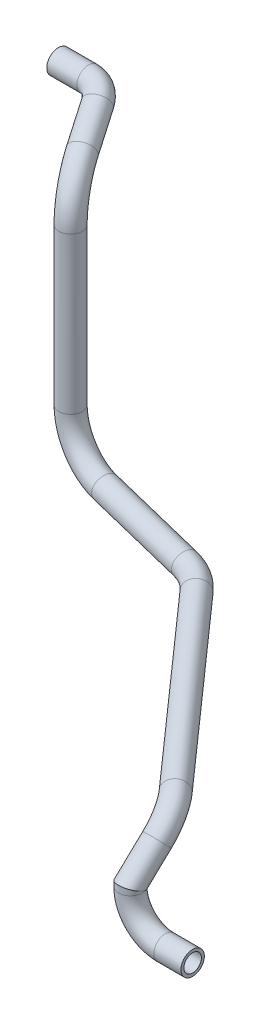
ISO-10303-21;
HEADER;
FILE_DESCRIPTION(('STEP AP214'),'2;1');
FILE_NAME('part.step','',(''),(''),'','','');
FILE_SCHEMA(('AUTOMOTIVE_DESIGN { 1 0 10303 214 1 1 1 1 }'));
ENDSEC;
DATA;
#1=APPLICATION_CONTEXT('core data for automotive mechanical design processes');
#2=APPLICATION_PROTOCOL_DEFINITION('international standard','automotive_design',2000,#1);
#3=PRODUCT_CONTEXT('',#1,'mechanical');
#4=PRODUCT('Part','Part','',(#3));
#5=PRODUCT_RELATED_PRODUCT_CATEGORY('part','',(#4));
#6=PRODUCT_DEFINITION_FORMATION('','',#4);
#7=PRODUCT_DEFINITION_CONTEXT('part definition',#1,'design');
#8=PRODUCT_DEFINITION('design','',#6,#7);
#9=PRODUCT_DEFINITION_SHAPE('','',#8);
#10=(LENGTH_UNIT() NAMED_UNIT(*) SI_UNIT(.MILLI.,.METRE.));
#11=(NAMED_UNIT(*) PLANE_ANGLE_UNIT() SI_UNIT($,.RADIAN.));
#12=(NAMED_UNIT(*) SI_UNIT($,.STERADIAN.) SOLID_ANGLE_UNIT());
#13=UNCERTAINTY_MEASURE_WITH_UNIT(LENGTH_MEASURE(1.E-05),#10,'distance_accuracy_value','');
#14=(GEOMETRIC_REPRESENTATION_CONTEXT(3) GLOBAL_UNCERTAINTY_ASSIGNED_CONTEXT((#13)) GLOBAL_UNIT_ASSIGNED_CONTEXT((#10,
#11,#12)) REPRESENTATION_CONTEXT('',''));
#15=CARTESIAN_POINT('',(0.,0.,0.));
#16=DIRECTION('',(0.,0.,1.));
#17=DIRECTION('',(1.,0.,0.));
#18=AXIS2_PLACEMENT_3D('',#15,#16,#17);
#19=CARTESIAN_POINT('',(1326.71933266064,229.978267256309,637.655463589521));
#20=DIRECTION('',(1.,1.91278449576007E-13,0.));
#21=DIRECTION('',(-1.82115262685281E-13,0.959887574891388,0.280385170023543));
#22=AXIS2_PLACEMENT_3D('',#19,#20,#21);
#23=PLANE('',#22);
#24=CARTESIAN_POINT('',(1326.71933266064,229.978267256309,637.655463589521));
#25=DIRECTION('',(1.,1.91278449576007E-13,0.));
#26=DIRECTION('',(-1.82115262685281E-13,0.959887574891388,0.280385170023543));
#27=AXIS2_PLACEMENT_3D('',#24,#25,#26);
#28=CIRCLE('',#27,7.50000000000001);
#29=CARTESIAN_POINT('',(1326.71933266064,237.478267256309,637.655463589521));
#30=VERTEX_POINT('',#29);
#31=EDGE_CURVE('E108',#30,#30,#28,.T.);
#32=ORIENTED_EDGE('',*,*,#31,.F.);
#33=EDGE_LOOP('',(#32));
#34=FACE_BOUND('',#33,.T.);
#35=CARTESIAN_POINT('',(1326.71933266064,229.978267256309,637.655463589521));
#36=DIRECTION('',(1.,1.91278449576007E-13,0.));
#37=DIRECTION('',(-1.91278449576007E-13,1.,0.));
#38=AXIS2_PLACEMENT_3D('',#35,#36,#37);
#39=CIRCLE('',#38,10.);
#40=CARTESIAN_POINT('',(1326.71933266064,239.978267256309,637.655463589521));
#41=VERTEX_POINT('',#40);
#42=EDGE_CURVE('E216',#41,#41,#39,.T.);
#43=ORIENTED_EDGE('',*,*,#42,.T.);
#44=EDGE_LOOP('',(#43));
#45=FACE_BOUND('',#44,.T.);
#46=ADVANCED_FACE('F45',(#34,#45),#23,.T.);
#47=CARTESIAN_POINT('',(924.394560432527,551.886928198318,349.944058457307));
#48=DIRECTION('',(1.,0.,0.));
#49=DIRECTION('',(0.,0.,-1.));
#50=AXIS2_PLACEMENT_3D('',#47,#48,#49);
#51=PLANE('',#50);
#52=CARTESIAN_POINT('',(924.394560432527,551.886928198318,349.944058457307));
#53=DIRECTION('',(1.,0.,0.));
#54=DIRECTION('',(0.,0.,-1.));
#55=AXIS2_PLACEMENT_3D('',#52,#53,#54);
#56=CIRCLE('',#55,7.50000000000001);
#57=CARTESIAN_POINT('',(924.394560432527,551.886928198318,342.444058457307));
#58=VERTEX_POINT('',#57);
#59=EDGE_CURVE('E110',#58,#58,#56,.T.);
#60=ORIENTED_EDGE('',*,*,#59,.T.);
#61=EDGE_LOOP('',(#60));
#62=FACE_BOUND('',#61,.T.);
#63=CARTESIAN_POINT('',(924.394560432527,551.886928198318,349.944058457307));
#64=DIRECTION('',(1.,0.,0.));
#65=DIRECTION('',(0.,0.,-1.));
#66=AXIS2_PLACEMENT_3D('',#63,#64,#65);
#67=CIRCLE('',#66,10.);
#68=CARTESIAN_POINT('',(924.394560432527,551.886928198318,339.944058457307));
#69=VERTEX_POINT('',#68);
#70=EDGE_CURVE('E49',#69,#69,#67,.T.);
#71=ORIENTED_EDGE('',*,*,#70,.F.);
#72=EDGE_LOOP('',(#71));
#73=FACE_BOUND('',#72,.T.);
#74=ADVANCED_FACE('F129',(#62,#73),#51,.F.);
#75=CARTESIAN_POINT('',(1303.5027571416,259.978267256305,637.655463589521));
#76=DIRECTION('',(0.,0.,1.));
#77=DIRECTION('',(1.,0.,0.));
#78=AXIS2_PLACEMENT_3D('',#75,#76,#77);
#79=TOROIDAL_SURFACE('',#78,29.9999999999998,10.);
#80=CARTESIAN_POINT('',(1263.98182357155,259.978267256305,634.597388385274));
#81=CARTESIAN_POINT('',(1264.02530421719,259.919516422859,634.46202464073));
#82=CARTESIAN_POINT('',(1264.0717736119,259.860712029914,634.327664404741));
#83=CARTESIAN_POINT('',(1264.1706544685,259.743312860982,634.061052613183));
#84=CARTESIAN_POINT('',(1264.22306602734,259.684718088432,633.928801092067));
#85=CARTESIAN_POINT('',(1264.38915745745,259.509727333325,633.535371212634));
#86=CARTESIAN_POINT('',(1264.51169492261,259.39412376748,633.277514922438));
#87=CARTESIAN_POINT('',(1264.78008096923,259.166687538459,632.771699525254));
#88=CARTESIAN_POINT('',(1264.92597937691,259.054863568399,632.523763021426));
#89=CARTESIAN_POINT('',(1265.2401968972,258.836665582143,632.039997792839));
#90=CARTESIAN_POINT('',(1265.40851433395,258.730291159405,631.804168164889));
#91=CARTESIAN_POINT('',(1265.76703549509,258.524026695621,631.345917713136));
#92=CARTESIAN_POINT('',(1265.95727981063,258.424149234084,631.123522958191));
#93=CARTESIAN_POINT('',(1266.35832160313,258.232213834752,630.694437885318));
#94=CARTESIAN_POINT('',(1266.56911844966,258.140155657262,630.487747086019));
#95=CARTESIAN_POINT('',(1267.00976423354,257.964965144727,630.092096021607));
#96=CARTESIAN_POINT('',(1267.23959381107,257.881823932389,629.903118146464));
#97=CARTESIAN_POINT('',(1267.71697302702,257.725296066663,629.544488825477));
#98=CARTESIAN_POINT('',(1267.9645215693,257.65190881067,629.374836185805));
#99=CARTESIAN_POINT('',(1268.46307680964,257.519056797342,629.064423115292));
#100=CARTESIAN_POINT('',(1268.71332167527,257.45908652215,628.922655180412));
#101=CARTESIAN_POINT('',(1269.22651868171,257.349356993228,628.659683292147));
#102=CARTESIAN_POINT('',(1269.4894695194,257.299596695095,628.538477235653));
#103=CARTESIAN_POINT('',(1270.02615945138,257.210810076757,628.317987280597));
#104=CARTESIAN_POINT('',(1270.29989837077,257.171783582615,628.218703026807));
#105=CARTESIAN_POINT('',(1270.85602171002,257.104873809584,628.043288626941));
#106=CARTESIAN_POINT('',(1271.13840558985,257.076989836185,627.967157037838));
#107=CARTESIAN_POINT('',(1271.6898386445,257.034158994872,627.843492789611));
#108=CARTESIAN_POINT('',(1271.95846976504,257.018454456958,627.794353716406));
#109=CARTESIAN_POINT('',(1272.49919455948,256.997039695264,627.717718036293));
#110=CARTESIAN_POINT('',(1272.77128806392,256.991328984227,627.690220374272));
#111=CARTESIAN_POINT('',(1273.31672997233,256.989878885704,627.65733383759));
#112=CARTESIAN_POINT('',(1273.59007784525,256.994135608514,627.651936340788));
#113=CARTESIAN_POINT('',(1274.13597270369,257.012462683753,627.663457884769));
#114=CARTESIAN_POINT('',(1274.40851971038,257.026532774348,627.680376330142));
#115=CARTESIAN_POINT('',(1274.93776641562,257.063314589054,627.735174695803));
#116=CARTESIAN_POINT('',(1275.19460444181,257.085584601899,627.772021931788));
#117=CARTESIAN_POINT('',(1275.70372989309,257.138437251726,627.865707147832));
#118=CARTESIAN_POINT('',(1275.95601749748,257.169019560436,627.922544338467));
#119=CARTESIAN_POINT('',(1276.45425572186,257.238069469412,628.055758885636));
#120=CARTESIAN_POINT('',(1276.70020666815,257.276536662757,628.132135233847));
#121=CARTESIAN_POINT('',(1277.18411626162,257.360859753398,628.303780559127));
#122=CARTESIAN_POINT('',(1277.42207481614,257.406715736322,628.399049755143));
#123=CARTESIAN_POINT('',(1277.88816978576,257.505202688651,628.607515628218));
#124=CARTESIAN_POINT('',(1278.11631809738,257.55782512465,628.720689765461));
#125=CARTESIAN_POINT('',(1278.56173945621,257.669306989327,628.964060743184));
#126=CARTESIAN_POINT('',(1278.77901255941,257.728166385889,629.094257496011));
#127=CARTESIAN_POINT('',(1279.20150309328,257.851532568191,629.370562332977));
#128=CARTESIAN_POINT('',(1279.4067200701,257.916039566314,629.516671015544));
#129=CARTESIAN_POINT('',(1279.80409820257,258.050123909875,629.823592302212));
#130=CARTESIAN_POINT('',(1279.99625815758,258.11970172038,629.984406255339));
#131=CARTESIAN_POINT('',(1280.37682388871,258.267313450438,630.328626954554));
#132=CARTESIAN_POINT('',(1280.56444806058,258.345601779865,630.512788616528));
#133=CARTESIAN_POINT('',(1280.92347319595,258.506640236142,630.894496786389));
#134=CARTESIAN_POINT('',(1281.09487278363,258.589390740448,631.092044426962));
#135=CARTESIAN_POINT('',(1281.42089870901,258.758902891765,631.498987982933));
#136=CARTESIAN_POINT('',(1281.57552022843,258.845665680865,631.708387275725));
#137=CARTESIAN_POINT('',(1281.86751428816,259.022861981623,632.137394217022));
#138=CARTESIAN_POINT('',(1282.00488786293,259.113295272707,632.357001252223));
#139=CARTESIAN_POINT('',(1282.21840762213,259.266419758863,632.728717786881));
#140=CARTESIAN_POINT('',(1282.29950481537,259.328103954833,632.878425702239));
#141=CARTESIAN_POINT('',(1282.45399130726,259.453120381867,633.181069167841));
#142=CARTESIAN_POINT('',(1282.52738181704,259.516452352025,633.33400420639));
#143=CARTESIAN_POINT('',(1282.66622354209,259.644765114301,633.642151819448));
#144=CARTESIAN_POINT('',(1282.73169692156,259.709740657208,633.79735660488));
#145=CARTESIAN_POINT('',(1282.8549351749,259.8420772792,634.109819077006));
#146=CARTESIAN_POINT('',(1282.91269919601,259.909438621138,634.267076988689));
#147=CARTESIAN_POINT('',(1282.96659484574,259.978267256305,634.425018432948));
#148=B_SPLINE_CURVE_WITH_KNOTS('',3,(#80,#81,#82,#83,#84,#85,#86,#87,#88,#89,#90,#91,#92,#93,
#94,#95,#96,#97,#98,#99,#100,#101,#102,#103,#104,#105,#106,#107,#108,#109,#110,#111,#112,#113,
#114,#115,#116,#117,#118,#119,#120,#121,#122,#123,#124,#125,#126,#127,#128,#129,#130,#131,#132,
#133,#134,#135,#136,#137,#138,#139,#140,#141,#142,#143,#144,#145,#146,#147),.UNSPECIFIED.,.F.,
.F.,(4,2,2,2,2,2,2,2,2,2,2,2,2,2,2,2,2,2,2,2,2,2,2,2,2,2,2,2,2,2,2,2,2,4),(0.,0.461440553169758,
0.922888637512019,1.84577590288652,2.77065846451886,3.69547192797506,4.622025773743,
5.5485512065477,6.47414550241863,7.39968258806917,8.27993455517271,9.16009643406635,
10.0402440494811,10.9203367970273,11.7399193644963,12.5594619713566,13.3786848120585,
14.1978857955938,14.9782167671175,15.7585169260206,16.5387768254664,17.3190457677509,
18.0983401638465,18.8776305473288,19.6569502491247,20.4363415157453,21.2584060724022,
22.0805402770337,22.9029099585144,23.7252302938308,24.2683221463531,24.8113285234584,
25.3527777048265,25.8942867267905),.UNSPECIFIED.);
#149=CARTESIAN_POINT('',(1263.98182357155,259.978267256305,634.597388385274));
#150=VERTEX_POINT('',#149);
#151=CARTESIAN_POINT('',(1282.96659484574,259.978267256305,634.425018432948));
#152=VERTEX_POINT('',#151);
#153=EDGE_CURVE('E12',#150,#152,#148,.T.);
#154=ORIENTED_EDGE('',*,*,#153,.T.);
#155=CARTESIAN_POINT('',(1273.5027571416,259.978267256305,637.655463589521));
#156=DIRECTION('',(0.,1.,0.));
#157=DIRECTION('',(-1.,0.,0.));
#158=AXIS2_PLACEMENT_3D('',#155,#156,#157);
#159=CIRCLE('',#158,10.);
#160=EDGE_CURVE('E80',#152,#150,#159,.F.);
#161=ORIENTED_EDGE('',*,*,#160,.T.);
#162=EDGE_LOOP('',(#154,#161));
#163=FACE_BOUND('',#162,.T.);
#164=CARTESIAN_POINT('',(1303.5027571416,229.978267256305,637.655463589521));
#165=DIRECTION('',(1.,1.78130524173896E-13,0.));
#166=DIRECTION('',(-1.78130524173896E-13,1.,0.));
#167=AXIS2_PLACEMENT_3D('',#164,#165,#166);
#168=CIRCLE('',#167,10.);
#169=CARTESIAN_POINT('',(1303.5027571416,239.978267256305,637.655463589521));
#170=VERTEX_POINT('',#169);
#171=EDGE_CURVE('E218',#170,#170,#168,.T.);
#172=ORIENTED_EDGE('',*,*,#171,.F.);
#173=EDGE_LOOP('',(#172));
#174=FACE_BOUND('',#173,.T.);
#175=ADVANCED_FACE('F124',(#163,#174),#79,.T.);
#176=CARTESIAN_POINT('',(1303.5027571416,229.978267256305,637.655463589521));
#177=DIRECTION('',(1.,1.78130524173896E-13,0.));
#178=DIRECTION('',(-1.78130524173896E-13,1.,0.));
#179=AXIS2_PLACEMENT_3D('',#176,#177,#178);
#180=CYLINDRICAL_SURFACE('',#179,10.);
#181=ORIENTED_EDGE('',*,*,#42,.F.);
#182=EDGE_LOOP('',(#181));
#183=FACE_BOUND('',#182,.T.);
#184=ORIENTED_EDGE('',*,*,#171,.T.);
#185=EDGE_LOOP('',(#184));
#186=FACE_BOUND('',#185,.T.);
#187=ADVANCED_FACE('F128',(#183,#186),#180,.T.);
#188=CARTESIAN_POINT('',(1273.5027571416,269.358231494666,637.655463589521));
#189=DIRECTION('',(0.,-1.,0.));
#190=DIRECTION('',(0.,0.,-1.));
#191=AXIS2_PLACEMENT_3D('',#188,#189,#190);
#192=CYLINDRICAL_SURFACE('',#191,10.);
#193=ORIENTED_EDGE('',*,*,#160,.F.);
#194=CARTESIAN_POINT('',(1273.5027571416,261.346615098881,637.655463589521));
#195=DIRECTION('',(0.0036227570881128,-0.916939720474375,0.399009303961017));
#196=DIRECTION('',(-0.00832490102017448,-0.399025749816193,-0.916901928783351));
#197=AXIS2_PLACEMENT_3D('',#194,#195,#196);
#198=ELLIPSE('',#197,10.9058423107972,10.);
#199=EDGE_CURVE('E54',#152,#150,#198,.T.);
#200=ORIENTED_EDGE('',*,*,#199,.T.);
#201=EDGE_LOOP('',(#193,#200));
#202=FACE_BOUND('',#201,.T.);
#203=ADVANCED_FACE('F132',(#202),#192,.T.);
#204=CARTESIAN_POINT('',(924.394560432527,551.886928198318,349.944058457307));
#205=DIRECTION('',(1.,0.,0.));
#206=DIRECTION('',(0.,0.,-1.));
#207=AXIS2_PLACEMENT_3D('',#204,#205,#206);
#208=CYLINDRICAL_SURFACE('',#207,10.);
#209=ORIENTED_EDGE('',*,*,#70,.T.);
#210=EDGE_LOOP('',(#209));
#211=FACE_BOUND('',#210,.T.);
#212=CARTESIAN_POINT('',(950.051959041406,551.886928198417,349.944058457058));
#213=DIRECTION('',(-1.,4.02348238924295E-12,-8.99020734086618E-12));
#214=DIRECTION('',(-8.99020734086617E-12,0.,1.));
#215=AXIS2_PLACEMENT_3D('',#212,#213,#214);
#216=CIRCLE('',#215,10.);
#217=CARTESIAN_POINT('',(950.051959041504,555.971897918981,340.816461709717));
#218=VERTEX_POINT('',#217);
#219=EDGE_CURVE('E214',#218,#218,#216,.F.);
#220=ORIENTED_EDGE('',*,*,#219,.F.);
#221=EDGE_LOOP('',(#220));
#222=FACE_BOUND('',#221,.T.);
#223=ADVANCED_FACE('F136',(#211,#222),#208,.T.);
#224=CARTESIAN_POINT('',(950.051959041209,543.716988757178,368.199251951984));
#225=DIRECTION('',(0.,-0.912759674734094,-0.408496972056478));
#226=DIRECTION('',(0.,0.408496972056478,-0.912759674734094));
#227=AXIS2_PLACEMENT_3D('',#224,#225,#226);
#228=TOROIDAL_SURFACE('',#227,20.0000000002676,10.);
#229=CARTESIAN_POINT('',(967.94091115379,547.370363158069,360.036026621229));
#230=DIRECTION('',(0.447172763911726,-0.365379138562776,0.816415705580601));
#231=DIRECTION('',(0.877056450674605,0.,-0.48038732532204));
#232=AXIS2_PLACEMENT_3D('',#229,#230,#231);
#233=CIRCLE('',#232,10.);
#234=CARTESIAN_POINT('',(976.88538721032,549.197050358564,355.954413955742));
#235=VERTEX_POINT('',#234);
#236=EDGE_CURVE('E211',#235,#235,#233,.T.);
#237=CARTESIAN_POINT('',(950.051959041209,543.716988757178,368.199251951984));
#238=DIRECTION('',(0.,-0.912759674734094,-0.408496972056478));
#239=DIRECTION('',(0.,0.408496972056478,-0.912759674734094));
#240=AXIS2_PLACEMENT_3D('',#237,#238,#239);
#241=CIRCLE('',#240,30.0000000002676);
#242=EDGE_CURVE('',#218,#235,#241,.T.);
#243=ORIENTED_EDGE('',*,*,#219,.T.);
#244=ORIENTED_EDGE('',*,*,#236,.F.);
#245=ORIENTED_EDGE('',*,*,#242,.T.);
#246=ORIENTED_EDGE('',*,*,#242,.F.);
#247=EDGE_LOOP('',(#243,#245,#244,#246));
#248=FACE_BOUND('',#247,.T.);
#249=ADVANCED_FACE('F139',(#248),#228,.T.);
#250=CARTESIAN_POINT('',(967.94091115379,547.370363158069,360.036026621229));
#251=DIRECTION('',(0.447172763911726,-0.365379138562776,0.816415705580601));
#252=DIRECTION('',(0.877056450674605,0.,-0.48038732532204));
#253=AXIS2_PLACEMENT_3D('',#250,#251,#252);
#254=CYLINDRICAL_SURFACE('',#253,10.);
#255=CARTESIAN_POINT('',(983.689410480829,534.502466045028,388.788498210619));
#256=DIRECTION('',(-0.447172763911711,0.365379138562786,-0.816415705580605));
#257=DIRECTION('',(-0.877056450674613,0.,0.480387325322026));
#258=AXIS2_PLACEMENT_3D('',#255,#256,#257);
#259=CIRCLE('',#258,10.);
#260=CARTESIAN_POINT('',(985.444645551856,543.811053935268,391.993079514803));
#261=VERTEX_POINT('',#260);
#262=EDGE_CURVE('E208',#261,#261,#259,.F.);
#263=ORIENTED_EDGE('',*,*,#262,.F.);
#264=EDGE_LOOP('',(#263));
#265=FACE_BOUND('',#264,.T.);
#266=ORIENTED_EDGE('',*,*,#236,.T.);
#267=EDGE_LOOP('',(#266));
#268=FACE_BOUND('',#267,.T.);
#269=ADVANCED_FACE('F143',(#265,#268),#254,.T.);
#270=CARTESIAN_POINT('',(976.668470196724,497.268114484071,375.970172993882));
#271=DIRECTION('',(0.877056450674613,0.,-0.480387325322027));
#272=DIRECTION('',(-0.480387325322027,0.,-0.877056450674613));
#273=AXIS2_PLACEMENT_3D('',#270,#271,#272);
#274=TOROIDAL_SURFACE('',#273,39.9999999999999,10.);
#275=CARTESIAN_POINT('',(995.883963209605,497.268114484071,411.052431020866));
#276=DIRECTION('',(0.,-1.,0.));
#277=DIRECTION('',(0.,0.,-1.));
#278=AXIS2_PLACEMENT_3D('',#275,#276,#277);
#279=CIRCLE('',#278,10.);
#280=CARTESIAN_POINT('',(1000.68783646283,497.268114484071,419.822995527612));
#281=VERTEX_POINT('',#280);
#282=EDGE_CURVE('E205',#281,#281,#279,.T.);
#283=CARTESIAN_POINT('',(976.668470196724,497.268114484071,375.970172993882));
#284=DIRECTION('',(0.877056450674613,0.,-0.480387325322027));
#285=DIRECTION('',(-0.480387325322027,0.,-0.877056450674613));
#286=AXIS2_PLACEMENT_3D('',#283,#284,#285);
#287=CIRCLE('',#286,49.9999999999999);
#288=EDGE_CURVE('',#261,#281,#287,.T.);
#289=ORIENTED_EDGE('',*,*,#262,.T.);
#290=ORIENTED_EDGE('',*,*,#282,.F.);
#291=ORIENTED_EDGE('',*,*,#288,.T.);
#292=ORIENTED_EDGE('',*,*,#288,.F.);
#293=EDGE_LOOP('',(#289,#291,#290,#292));
#294=FACE_BOUND('',#293,.T.);
#295=ADVANCED_FACE('F147',(#294),#274,.T.);
#296=CARTESIAN_POINT('',(995.883963209605,497.268114484071,411.052431020866));
#297=DIRECTION('',(0.,-1.,0.));
#298=DIRECTION('',(0.,0.,-1.));
#299=AXIS2_PLACEMENT_3D('',#296,#297,#298);
#300=CYLINDRICAL_SURFACE('',#299,10.);
#301=CARTESIAN_POINT('',(995.883963209605,363.99398977692,411.052431020866));
#302=DIRECTION('',(0.,1.,0.));
#303=DIRECTION('',(-1.,0.,0.));
#304=AXIS2_PLACEMENT_3D('',#301,#302,#303);
#305=CIRCLE('',#304,10.);
#306=CARTESIAN_POINT('',(986.037233937508,363.99398977692,409.308320175184));
#307=VERTEX_POINT('',#306);
#308=EDGE_CURVE('E202',#307,#307,#305,.F.);
#309=ORIENTED_EDGE('',*,*,#308,.F.);
#310=EDGE_LOOP('',(#309));
#311=FACE_BOUND('',#310,.T.);
#312=ORIENTED_EDGE('',*,*,#282,.T.);
#313=EDGE_LOOP('',(#312));
#314=FACE_BOUND('',#313,.T.);
#315=ADVANCED_FACE('F151',(#311,#314),#300,.T.);
#316=CARTESIAN_POINT('',(1035.27088029799,363.99398977692,418.028874403593));
#317=DIRECTION('',(-0.174411084568181,0.,0.984672927209716));
#318=DIRECTION('',(0.984672927209716,0.,0.174411084568181));
#319=AXIS2_PLACEMENT_3D('',#316,#317,#318);
#320=TOROIDAL_SURFACE('',#319,40.0000000000003,10.);
#321=CARTESIAN_POINT('',(1031.7211454463,324.156770296676,417.400124401125));
#322=DIRECTION('',(0.980665787937679,-0.0901247194271574,0.173701316393248));
#323=DIRECTION('',(0.174411084568181,0.,-0.984672927209716));
#324=AXIS2_PLACEMENT_3D('',#321,#322,#323);
#325=CIRCLE('',#324,10.);
#326=CARTESIAN_POINT('',(1030.83371173338,314.197465426615,417.242936900508));
#327=VERTEX_POINT('',#326);
#328=EDGE_CURVE('E199',#327,#327,#325,.T.);
#329=CARTESIAN_POINT('',(1035.27088029799,363.99398977692,418.028874403593));
#330=DIRECTION('',(-0.174411084568181,0.,0.984672927209716));
#331=DIRECTION('',(0.984672927209716,0.,0.174411084568181));
#332=AXIS2_PLACEMENT_3D('',#329,#330,#331);
#333=CIRCLE('',#332,50.0000000000003);
#334=EDGE_CURVE('',#307,#327,#333,.T.);
#335=ORIENTED_EDGE('',*,*,#308,.T.);
#336=ORIENTED_EDGE('',*,*,#328,.F.);
#337=ORIENTED_EDGE('',*,*,#334,.T.);
#338=ORIENTED_EDGE('',*,*,#334,.F.);
#339=EDGE_LOOP('',(#335,#337,#336,#338));
#340=FACE_BOUND('',#339,.T.);
#341=ADVANCED_FACE('F155',(#340),#320,.T.);
#342=CARTESIAN_POINT('',(1031.7211454463,324.156770296676,417.400124401125));
#343=DIRECTION('',(0.980665787937679,-0.0901247194271574,0.173701316393248));
#344=DIRECTION('',(0.174411084568181,0.,-0.984672927209716));
#345=AXIS2_PLACEMENT_3D('',#342,#343,#344);
#346=CYLINDRICAL_SURFACE('',#345,10.);
#347=CARTESIAN_POINT('',(1114.53757456698,316.545810956332,432.069059459523));
#348=DIRECTION('',(-0.980665787937678,0.0901247194271558,-0.173701316393255));
#349=DIRECTION('',(-0.174411084568188,0.,0.984672927209715));
#350=AXIS2_PLACEMENT_3D('',#347,#348,#349);
#351=CIRCLE('',#350,10.);
#352=CARTESIAN_POINT('',(1116.30494994655,316.813997202408,422.230133684566));
#353=VERTEX_POINT('',#352);
#354=EDGE_CURVE('E196',#353,#353,#351,.F.);
#355=ORIENTED_EDGE('',*,*,#354,.F.);
#356=EDGE_LOOP('',(#355));
#357=FACE_BOUND('',#356,.T.);
#358=ORIENTED_EDGE('',*,*,#328,.T.);
#359=EDGE_LOOP('',(#358));
#360=FACE_BOUND('',#359,.T.);
#361=ADVANCED_FACE('F159',(#357,#360),#346,.T.);
#362=CARTESIAN_POINT('',(1107.4680730487,315.473065972029,471.42476255935));
#363=DIRECTION('',(-0.0840146120950681,-0.99556933275505,-0.0422285286527977));
#364=DIRECTION('',(0.996458195554835,-0.0840896219018919,0.));
#365=AXIS2_PLACEMENT_3D('',#362,#363,#364);
#366=TOROIDAL_SURFACE('',#365,40.,10.);
#367=CARTESIAN_POINT('',(1137.49967544678,314.057847324898,445.041055208322));
#368=DIRECTION('',(0.655176183046922,-0.0871201830270747,0.750436035167152));
#369=DIRECTION('',(0.753300226868124,0.,-0.657676796154793));
#370=AXIS2_PLACEMENT_3D('',#367,#368,#369);
#371=CIRCLE('',#370,10.);
#372=CARTESIAN_POINT('',(1145.0075760463,313.704042663115,438.445128370565));
#373=VERTEX_POINT('',#372);
#374=EDGE_CURVE('E191',#373,#373,#371,.T.);
#375=CARTESIAN_POINT('',(1107.4680730487,315.473065972029,471.42476255935));
#376=DIRECTION('',(-0.0840146120950681,-0.99556933275505,-0.0422285286527977));
#377=DIRECTION('',(0.996458195554835,-0.0840896219018919,0.));
#378=AXIS2_PLACEMENT_3D('',#375,#376,#377);
#379=CIRCLE('',#378,50.);
#380=EDGE_CURVE('',#353,#373,#379,.T.);
#381=ORIENTED_EDGE('',*,*,#354,.T.);
#382=ORIENTED_EDGE('',*,*,#374,.F.);
#383=ORIENTED_EDGE('',*,*,#380,.T.);
#384=ORIENTED_EDGE('',*,*,#380,.F.);
#385=EDGE_LOOP('',(#381,#383,#382,#384));
#386=FACE_BOUND('',#385,.T.);
#387=ADVANCED_FACE('F163',(#386),#366,.T.);
#388=CARTESIAN_POINT('',(1137.49967544678,314.057847324898,445.041055208322));
#389=DIRECTION('',(0.655176183046922,-0.0871201830270747,0.750436035167152));
#390=DIRECTION('',(0.753300226868124,0.,-0.657676796154793));
#391=AXIS2_PLACEMENT_3D('',#388,#389,#390);
#392=CYLINDRICAL_SURFACE('',#391,10.);
#393=CARTESIAN_POINT('',(1260.32492058687,297.725510903285,585.724572659633));
#394=DIRECTION('',(-0.655176183046928,0.087120183027064,-0.750436035167148));
#395=DIRECTION('',(-0.753300226868119,0.,0.657676796154798));
#396=AXIS2_PLACEMENT_3D('',#393,#394,#395);
#397=CIRCLE('',#396,10.);
#398=CARTESIAN_POINT('',(1265.32215986605,305.674968182042,582.284553973651));
#399=VERTEX_POINT('',#398);
#400=EDGE_CURVE('E187',#399,#399,#397,.F.);
#401=ORIENTED_EDGE('',*,*,#400,.F.);
#402=EDGE_LOOP('',(#401));
#403=FACE_BOUND('',#402,.T.);
#404=ORIENTED_EDGE('',*,*,#374,.T.);
#405=EDGE_LOOP('',(#404));
#406=FACE_BOUND('',#405,.T.);
#407=ADVANCED_FACE('F166',(#403,#406),#392,.T.);
#408=CARTESIAN_POINT('',(1240.33596347018,265.927681788258,599.484647403564));
#409=DIRECTION('',(0.566586414446157,-0.60039267437364,-0.564365547782211));
#410=DIRECTION('',(0.727285876402972,0.686334651598446,0.));
#411=AXIS2_PLACEMENT_3D('',#408,#409,#410);
#412=TOROIDAL_SURFACE('',#411,40.,10.);
#413=CARTESIAN_POINT('',(1273.29498520855,282.661304274224,614.771529510362));
#414=DIRECTION('',(0.00664369974344142,-0.68155690196725,0.73173495928138));
#415=DIRECTION('',(0.,-0.731751108747851,-0.681571943998791));
#416=AXIS2_PLACEMENT_3D('',#413,#414,#415);
#417=CIRCLE('',#416,10.);
#418=CARTESIAN_POINT('',(1281.53474064314,286.844709895715,618.593250037061));
#419=VERTEX_POINT('',#418);
#420=EDGE_CURVE('E186',#419,#419,#417,.T.);
#421=CARTESIAN_POINT('',(1240.33596347018,265.927681788258,599.484647403564));
#422=DIRECTION('',(0.566586414446157,-0.60039267437364,-0.564365547782211));
#423=DIRECTION('',(0.727285876402972,0.686334651598446,0.));
#424=AXIS2_PLACEMENT_3D('',#421,#422,#423);
#425=CIRCLE('',#424,50.);
#426=EDGE_CURVE('',#399,#419,#425,.T.);
#427=ORIENTED_EDGE('',*,*,#400,.T.);
#428=ORIENTED_EDGE('',*,*,#420,.F.);
#429=ORIENTED_EDGE('',*,*,#426,.T.);
#430=ORIENTED_EDGE('',*,*,#426,.F.);
#431=EDGE_LOOP('',(#427,#429,#428,#430));
#432=FACE_BOUND('',#431,.T.);
#433=ADVANCED_FACE('F47',(#432),#412,.T.);
#434=CARTESIAN_POINT('',(1273.29498520855,282.661304274224,614.771529510362));
#435=DIRECTION('',(0.00664369974344142,-0.68155690196725,0.73173495928138));
#436=DIRECTION('',(0.,-0.731751108747851,-0.681571943998791));
#437=AXIS2_PLACEMENT_3D('',#434,#435,#436);
#438=CYLINDRICAL_SURFACE('',#437,10.);
#439=ORIENTED_EDGE('',*,*,#153,.F.);
#440=ORIENTED_EDGE('',*,*,#199,.F.);
#441=EDGE_LOOP('',(#439,#440));
#442=FACE_BOUND('',#441,.T.);
#443=ORIENTED_EDGE('',*,*,#420,.T.);
#444=EDGE_LOOP('',(#443));
#445=FACE_BOUND('',#444,.T.);
#446=ADVANCED_FACE('F121',(#442,#445),#438,.T.);
#447=CARTESIAN_POINT('',(1303.5027571416,259.978267256305,637.655463589521));
#448=DIRECTION('',(0.,0.,1.));
#449=DIRECTION('',(1.,0.,0.));
#450=AXIS2_PLACEMENT_3D('',#447,#448,#449);
#451=TOROIDAL_SURFACE('',#450,29.9999999999998,7.50000000000001);
#452=CARTESIAN_POINT('',(1266.6652574301,259.978467256305,634.573484081507));
#453=CARTESIAN_POINT('',(1266.75153614024,259.895444340289,634.382051314528));
#454=CARTESIAN_POINT('',(1266.84624356268,259.813242187844,634.194039365777));
#455=CARTESIAN_POINT('',(1267.05206996289,259.6515249111,633.825939446046));
#456=CARTESIAN_POINT('',(1267.16319343053,259.572010529254,633.645853660459));
#457=CARTESIAN_POINT('',(1267.40165762795,259.41656581255,633.294353273258));
#458=CARTESIAN_POINT('',(1267.5290384262,259.340644990682,633.12296160954));
#459=CARTESIAN_POINT('',(1267.79915282188,259.193467292409,632.790607631617));
#460=CARTESIAN_POINT('',(1267.94188500711,259.122209987968,632.629644360268));
#461=CARTESIAN_POINT('',(1268.24228255407,258.984989087394,632.319073270507));
#462=CARTESIAN_POINT('',(1268.39998034381,258.919037586554,632.169491437446));
#463=CARTESIAN_POINT('',(1268.72911101125,258.793330344846,631.883402128299));
#464=CARTESIAN_POINT('',(1268.90054337675,258.733574373119,631.746894165067));
#465=CARTESIAN_POINT('',(1269.25584711724,258.620985658599,631.488407756042));
#466=CARTESIAN_POINT('',(1269.43970372175,258.568144906852,631.366412517321));
#467=CARTESIAN_POINT('',(1269.818758371,258.469905233623,631.138044360832));
#468=CARTESIAN_POINT('',(1270.01395563153,258.424505798406,631.031670364652));
#469=CARTESIAN_POINT('',(1270.40332597571,258.3439282086,630.841084717437));
#470=CARTESIAN_POINT('',(1270.5969755183,258.308327952836,630.755981398317));
#471=CARTESIAN_POINT('',(1270.99172180091,258.244619384313,630.601750078953));
#472=CARTESIAN_POINT('',(1271.19281797919,258.216510507759,630.532620876562));
#473=CARTESIAN_POINT('',(1271.60093132238,258.168075565182,630.411157892262));
#474=CARTESIAN_POINT('',(1271.80794828853,258.147749238213,630.358823547237));
#475=CARTESIAN_POINT('',(1272.22624811087,258.115080023997,630.271628935225));
#476=CARTESIAN_POINT('',(1272.43753073188,258.102736697839,630.236767707579));
#477=CARTESIAN_POINT('',(1272.84849026539,258.08668251086,630.186736787315));
#478=CARTESIAN_POINT('',(1273.04800743758,258.082453376502,630.170414357464));
#479=CARTESIAN_POINT('',(1273.44772921756,258.08103570526,630.153687537977));
#480=CARTESIAN_POINT('',(1273.64793379053,258.083846816776,630.153282353428));
#481=CARTESIAN_POINT('',(1274.04746913764,258.096421748395,630.168470871195));
#482=CARTESIAN_POINT('',(1274.24680010081,258.106183981394,630.184060921779));
#483=CARTESIAN_POINT('',(1274.64312180015,258.132492188454,630.231140946167));
#484=CARTESIAN_POINT('',(1274.84011255784,258.149038100078,630.262630773629));
#485=CARTESIAN_POINT('',(1275.22416052097,258.188049074466,630.340004775042));
#486=CARTESIAN_POINT('',(1275.41133559545,258.2103124806,630.385407138399));
#487=CARTESIAN_POINT('',(1275.78090299709,258.26070695575,630.490494906631));
#488=CARTESIAN_POINT('',(1275.96329337525,258.288840375315,630.550186034622));
#489=CARTESIAN_POINT('',(1276.3219661727,258.350633684801,630.6832820919));
#490=CARTESIAN_POINT('',(1276.49825034285,258.384291974396,630.756683050866));
#491=CARTESIAN_POINT('',(1276.8436165785,258.45676672302,630.916518222961));
#492=CARTESIAN_POINT('',(1277.01270124623,258.495581297057,631.002947674789));
#493=CARTESIAN_POINT('',(1277.3464290933,258.578911730204,631.190149386129));
#494=CARTESIAN_POINT('',(1277.51089102397,258.623534800424,631.291196857887));
#495=CARTESIAN_POINT('',(1277.8304597452,258.717372924166,631.505234783323));
#496=CARTESIAN_POINT('',(1277.98556634378,258.766588071864,631.618225481947));
#497=CARTESIAN_POINT('',(1278.28583044325,258.869266241814,631.855316405991));
#498=CARTESIAN_POINT('',(1278.43097683924,258.922733866392,631.979428686878));
#499=CARTESIAN_POINT('',(1278.71051388385,259.0334999312,632.237654247977));
#500=CARTESIAN_POINT('',(1278.84490389078,259.090798599601,632.371768123928));
#501=CARTESIAN_POINT('',(1279.10873631852,259.211796010938,632.655763368518));
#502=CARTESIAN_POINT('',(1279.23761266326,259.275670825429,632.806095477516));
#503=CARTESIAN_POINT('',(1279.48252759971,259.407000213535,633.115429098917));
#504=CARTESIAN_POINT('',(1279.59856432452,259.474455305628,633.274431867056));
#505=CARTESIAN_POINT('',(1279.81716820807,259.612591619213,633.599460767229));
#506=CARTESIAN_POINT('',(1279.91976760402,259.68326455018,633.765468777955));
#507=CARTESIAN_POINT('',(1280.111562261,259.828154635412,634.103478630769));
#508=CARTESIAN_POINT('',(1280.20076261016,259.902370430134,634.27547816692));
#509=CARTESIAN_POINT('',(1280.2831693294,259.978467256305,634.44984187523));
#510=B_SPLINE_CURVE_WITH_KNOTS('',3,(#452,#453,#454,#455,#456,#457,#458,#459,#460,#461,#462,
#463,#464,#465,#466,#467,#468,#469,#470,#471,#472,#473,#474,#475,#476,#477,#478,#479,#480,#481,
#482,#483,#484,#485,#486,#487,#488,#489,#490,#491,#492,#493,#494,#495,#496,#497,#498,#499,#500,
#501,#502,#503,#504,#505,#506,#507,#508,#509),.UNSPECIFIED.,.F.,.F.,(4,2,2,2,2,2,2,2,2,2,2,2,2,
2,2,2,2,2,2,2,2,2,2,2,2,2,2,2,4),(0.,0.677229947308254,1.35464546487792,2.03376403066819,
2.71282017664049,3.39338286823532,4.07392019148179,4.75366223151152,5.43335732348528,
6.07602333213648,6.7186409606755,7.36123704062325,8.0037977872129,8.60373852120206,
9.20364929389602,9.80342313673252,10.4031914593475,10.9841717416616,11.5653851160024,
12.1464304331826,12.7272639181109,13.3209586271388,13.914665514722,14.5090239333074,
15.1034177827942,15.7269688707036,16.3506105059185,16.9727274443263,17.5946075402081),.UNSPECIFIED.);
#511=CARTESIAN_POINT('',(1266.66536144914,259.978367256305,634.573253331129));
#512=VERTEX_POINT('',#511);
#513=CARTESIAN_POINT('',(1280.28306113926,259.978367256305,634.449613056352));
#514=VERTEX_POINT('',#513);
#515=EDGE_CURVE('E72',#512,#514,#510,.T.);
#516=ORIENTED_EDGE('',*,*,#515,.F.);
#517=CARTESIAN_POINT('',(1273.5027571416,259.978267256305,637.655463589521));
#518=DIRECTION('',(0.,-1.,0.));
#519=DIRECTION('',(0.959887574891388,0.,0.280385170023543));
#520=AXIS2_PLACEMENT_3D('',#517,#518,#519);
#521=CIRCLE('',#520,7.50000000000001);
#522=EDGE_CURVE('E82',#514,#512,#521,.T.);
#523=ORIENTED_EDGE('',*,*,#522,.F.);
#524=EDGE_LOOP('',(#516,#523));
#525=FACE_BOUND('',#524,.T.);
#526=CARTESIAN_POINT('',(1303.5027571416,229.978267256305,637.655463589521));
#527=DIRECTION('',(1.,1.83382122511301E-13,0.));
#528=DIRECTION('',(-1.74535676448591E-13,0.959887574891388,0.280385170023543));
#529=AXIS2_PLACEMENT_3D('',#526,#527,#528);
#530=CIRCLE('',#529,7.50000000000001);
#531=CARTESIAN_POINT('',(1303.5027571416,237.478267256305,637.655463589521));
#532=VERTEX_POINT('',#531);
#533=EDGE_CURVE('E86',#532,#532,#530,.T.);
#534=ORIENTED_EDGE('',*,*,#533,.T.);
#535=EDGE_LOOP('',(#534));
#536=FACE_BOUND('',#535,.T.);
#537=ADVANCED_FACE('F83',(#525,#536),#451,.F.);
#538=CARTESIAN_POINT('',(1303.5027571416,229.978267256305,637.655463589521));
#539=DIRECTION('',(1.,1.78130524173896E-13,0.));
#540=DIRECTION('',(-1.78130524173896E-13,1.,0.));
#541=AXIS2_PLACEMENT_3D('',#538,#539,#540);
#542=CYLINDRICAL_SURFACE('',#541,7.50000000000001);
#543=CARTESIAN_POINT('',(1326.71933266064,237.478267256309,637.655463589521));
#544=CARTESIAN_POINT('',(1326.47749333231,237.478267256309,637.655463589521));
#545=CARTESIAN_POINT('',(1326.23565400399,237.478267256309,637.655463589521));
#546=CARTESIAN_POINT('',(1325.75197534734,237.478267256309,637.655463589521));
#547=CARTESIAN_POINT('',(1325.51013601902,237.478267256309,637.655463589521));
#548=CARTESIAN_POINT('',(1325.02645736237,237.478267256309,637.655463589521));
#549=CARTESIAN_POINT('',(1324.78461803405,237.478267256309,637.655463589521));
#550=CARTESIAN_POINT('',(1324.3009393774,237.478267256309,637.655463589521));
#551=CARTESIAN_POINT('',(1324.05910004908,237.478267256309,637.655463589521));
#552=CARTESIAN_POINT('',(1323.57542139243,237.478267256309,637.655463589521));
#553=CARTESIAN_POINT('',(1323.33358206411,237.478267256309,637.655463589521));
#554=CARTESIAN_POINT('',(1322.84990340746,237.478267256309,637.655463589521));
#555=CARTESIAN_POINT('',(1322.60806407914,237.478267256309,637.655463589521));
#556=CARTESIAN_POINT('',(1322.12438542249,237.478267256309,637.655463589521));
#557=CARTESIAN_POINT('',(1321.88254609417,237.478267256309,637.655463589521));
#558=CARTESIAN_POINT('',(1321.39886743752,237.478267256308,637.655463589521));
#559=CARTESIAN_POINT('',(1321.1570281092,237.478267256308,637.655463589521));
#560=CARTESIAN_POINT('',(1320.67334945255,237.478267256308,637.655463589521));
#561=CARTESIAN_POINT('',(1320.43151012423,237.478267256308,637.655463589521));
#562=CARTESIAN_POINT('',(1319.94783146758,237.478267256308,637.655463589521));
#563=CARTESIAN_POINT('',(1319.70599213926,237.478267256308,637.655463589521));
#564=CARTESIAN_POINT('',(1319.22231348261,237.478267256308,637.655463589521));
#565=CARTESIAN_POINT('',(1318.98047415429,237.478267256308,637.655463589521));
#566=CARTESIAN_POINT('',(1318.49679549764,237.478267256308,637.655463589521));
#567=CARTESIAN_POINT('',(1318.25495616932,237.478267256308,637.655463589521));
#568=CARTESIAN_POINT('',(1317.77127751267,237.478267256308,637.655463589521));
#569=CARTESIAN_POINT('',(1317.52943818435,237.478267256308,637.655463589521));
#570=CARTESIAN_POINT('',(1317.0457595277,237.478267256308,637.655463589521));
#571=CARTESIAN_POINT('',(1316.80392019938,237.478267256308,637.655463589521));
#572=CARTESIAN_POINT('',(1316.32024154273,237.478267256308,637.655463589521));
#573=CARTESIAN_POINT('',(1316.07840221441,237.478267256308,637.655463589521));
#574=CARTESIAN_POINT('',(1315.59472355776,237.478267256307,637.655463589521));
#575=CARTESIAN_POINT('',(1315.35288422944,237.478267256307,637.655463589521));
#576=CARTESIAN_POINT('',(1314.8692055728,237.478267256307,637.655463589521));
#577=CARTESIAN_POINT('',(1314.62736624447,237.478267256307,637.655463589521));
#578=CARTESIAN_POINT('',(1314.14368758783,237.478267256307,637.655463589521));
#579=CARTESIAN_POINT('',(1313.9018482595,237.478267256307,637.655463589521));
#580=CARTESIAN_POINT('',(1313.41816960286,237.478267256307,637.655463589521));
#581=CARTESIAN_POINT('',(1313.17633027453,237.478267256307,637.655463589521));
#582=CARTESIAN_POINT('',(1312.69265161789,237.478267256307,637.655463589521));
#583=CARTESIAN_POINT('',(1312.45081228956,237.478267256307,637.655463589521));
#584=CARTESIAN_POINT('',(1311.96713363292,237.478267256307,637.655463589521));
#585=CARTESIAN_POINT('',(1311.72529430459,237.478267256307,637.655463589521));
#586=CARTESIAN_POINT('',(1311.24161564795,237.478267256307,637.655463589521));
#587=CARTESIAN_POINT('',(1310.99977631962,237.478267256307,637.655463589521));
#588=CARTESIAN_POINT('',(1310.51609766298,237.478267256307,637.655463589521));
#589=CARTESIAN_POINT('',(1310.27425833465,237.478267256307,637.655463589521));
#590=CARTESIAN_POINT('',(1309.79057967801,237.478267256306,637.655463589521));
#591=CARTESIAN_POINT('',(1309.54874034968,237.478267256306,637.655463589521));
#592=CARTESIAN_POINT('',(1309.06506169304,237.478267256306,637.655463589521));
#593=CARTESIAN_POINT('',(1308.82322236471,237.478267256306,637.655463589521));
#594=CARTESIAN_POINT('',(1308.33954370807,237.478267256306,637.655463589521));
#595=CARTESIAN_POINT('',(1308.09770437974,237.478267256306,637.655463589521));
#596=CARTESIAN_POINT('',(1307.6140257231,237.478267256306,637.655463589521));
#597=CARTESIAN_POINT('',(1307.37218639477,237.478267256306,637.655463589521));
#598=CARTESIAN_POINT('',(1306.88850773813,237.478267256306,637.655463589521));
#599=CARTESIAN_POINT('',(1306.6466684098,237.478267256306,637.655463589521));
#600=CARTESIAN_POINT('',(1306.16298975316,237.478267256306,637.655463589521));
#601=CARTESIAN_POINT('',(1305.92115042483,237.478267256306,637.655463589521));
#602=CARTESIAN_POINT('',(1305.43747176819,237.478267256306,637.655463589521));
#603=CARTESIAN_POINT('',(1305.19563243986,237.478267256306,637.655463589521));
#604=CARTESIAN_POINT('',(1304.71195378322,237.478267256305,637.655463589521));
#605=CARTESIAN_POINT('',(1304.47011445489,237.478267256305,637.655463589521));
#606=CARTESIAN_POINT('',(1303.98643579825,237.478267256305,637.655463589521));
#607=CARTESIAN_POINT('',(1303.74459646992,237.478267256305,637.655463589521));
#608=CARTESIAN_POINT('',(1303.5027571416,237.478267256305,637.655463589521));
#609=B_SPLINE_CURVE_WITH_KNOTS('',3,(#543,#544,#545,#546,#547,#548,#549,#550,#551,#552,#553,
#554,#555,#556,#557,#558,#559,#560,#561,#562,#563,#564,#565,#566,#567,#568,#569,#570,#571,#572,
#573,#574,#575,#576,#577,#578,#579,#580,#581,#582,#583,#584,#585,#586,#587,#588,#589,#590,#591,
#592,#593,#594,#595,#596,#597,#598,#599,#600,#601,#602,#603,#604,#605,#606,#607,#608),
.UNSPECIFIED.,.F.,.F.,(4,2,2,2,2,2,2,2,2,2,2,2,2,2,2,2,2,2,2,2,2,2,2,2,2,2,2,2,2,2,2,2,4),(0.,
0.725517984969892,1.45103596993978,2.17655395490968,2.90207193987957,3.62758992484946,
4.35310790981935,5.07862589478925,5.80414387975914,6.52966186472881,7.2551798496987,
7.98069783466859,8.70621581963849,9.43173380460838,10.1572517895783,10.8827697745482,
11.6082877595178,12.3338057444877,13.0593237294576,13.7848417144275,14.5103596993974,
15.2358776843673,15.9613956693372,16.6869136543071,17.412431639277,18.1379496242466,
18.8634676092165,19.5889855941864,20.3145035791563,21.0400215641262,21.7655395490961,
22.491057534066,23.2165755190357),.UNSPECIFIED.);
#610=EDGE_CURVE('BSEAM181',#30,#532,#609,.T.);
#611=ORIENTED_EDGE('',*,*,#31,.T.);
#612=ORIENTED_EDGE('',*,*,#533,.F.);
#613=ORIENTED_EDGE('',*,*,#610,.T.);
#614=ORIENTED_EDGE('',*,*,#610,.F.);
#615=EDGE_LOOP('',(#611,#613,#612,#614));
#616=FACE_BOUND('',#615,.T.);
#617=ADVANCED_FACE('F181',(#616),#542,.F.);
#618=CARTESIAN_POINT('',(1273.5027571416,269.358231494666,637.655463589521));
#619=DIRECTION('',(0.,-1.,0.));
#620=DIRECTION('',(0.,0.,-1.));
#621=AXIS2_PLACEMENT_3D('',#618,#619,#620);
#622=CYLINDRICAL_SURFACE('',#621,7.50000000000001);
#623=ORIENTED_EDGE('',*,*,#522,.T.);
#624=CARTESIAN_POINT('',(1273.5027571416,261.346615098881,637.655463589521));
#625=DIRECTION('',(0.0036227570881128,-0.916939720474375,0.399009303961017));
#626=DIRECTION('',(0.00832490102017448,0.399025749816193,0.916901928783351));
#627=AXIS2_PLACEMENT_3D('',#624,#625,#626);
#628=ELLIPSE('',#627,8.17938173309791,7.50000000000001);
#629=EDGE_CURVE('E77',#514,#512,#628,.T.);
#630=ORIENTED_EDGE('',*,*,#629,.F.);
#631=EDGE_LOOP('',(#623,#630));
#632=FACE_BOUND('',#631,.T.);
#633=ADVANCED_FACE('F88',(#632),#622,.F.);
#634=CARTESIAN_POINT('',(924.394560432527,551.886928198318,349.944058457307));
#635=DIRECTION('',(1.,0.,0.));
#636=DIRECTION('',(0.,0.,-1.));
#637=AXIS2_PLACEMENT_3D('',#634,#635,#636);
#638=CYLINDRICAL_SURFACE('',#637,7.50000000000001);
#639=ORIENTED_EDGE('',*,*,#59,.F.);
#640=EDGE_LOOP('',(#639));
#641=FACE_BOUND('',#640,.T.);
#642=CARTESIAN_POINT('',(950.051959041338,551.886928198314,349.944058456986));
#643=DIRECTION('',(1.,0.,0.));
#644=DIRECTION('',(0.,0.,-1.));
#645=AXIS2_PLACEMENT_3D('',#642,#643,#644);
#646=CIRCLE('',#645,7.50000000000001);
#647=CARTESIAN_POINT('',(950.051959041387,554.950655488686,343.098360896483));
#648=VERTEX_POINT('',#647);
#649=EDGE_CURVE('E291',#648,#648,#646,.T.);
#650=ORIENTED_EDGE('',*,*,#649,.T.);
#651=EDGE_LOOP('',(#650));
#652=FACE_BOUND('',#651,.T.);
#653=ADVANCED_FACE('F242',(#641,#652),#638,.F.);
#654=CARTESIAN_POINT('',(950.051959041209,543.716988757178,368.199251951984));
#655=DIRECTION('',(0.,-0.912759674734094,-0.408496972056478));
#656=DIRECTION('',(0.,0.408496972056478,-0.912759674734094));
#657=AXIS2_PLACEMENT_3D('',#654,#655,#656);
#658=TOROIDAL_SURFACE('',#657,20.0000000002676,7.50000000000001);
#659=CARTESIAN_POINT('',(967.94091115379,547.370363158065,360.036026621226));
#660=DIRECTION('',(0.447172763911728,-0.365379138562646,0.816415705580658));
#661=DIRECTION('',(0.816415705580661,-0.206126921852615,-0.539422921063609));
#662=AXIS2_PLACEMENT_3D('',#659,#660,#661);
#663=CIRCLE('',#662,7.50000000000001);
#664=CARTESIAN_POINT('',(974.649268196247,548.740378558447,356.974817122083));
#665=VERTEX_POINT('',#664);
#666=EDGE_CURVE('E293',#665,#665,#663,.T.);
#667=CARTESIAN_POINT('',(950.051959041209,543.716988757178,368.199251951984));
#668=DIRECTION('',(0.,-0.912759674734094,-0.408496972056478));
#669=DIRECTION('',(0.,0.408496972056478,-0.912759674734094));
#670=AXIS2_PLACEMENT_3D('',#667,#668,#669);
#671=CIRCLE('',#670,27.5000000002676);
#672=EDGE_CURVE('',#648,#665,#671,.T.);
#673=ORIENTED_EDGE('',*,*,#649,.F.);
#674=ORIENTED_EDGE('',*,*,#666,.T.);
#675=ORIENTED_EDGE('',*,*,#672,.T.);
#676=ORIENTED_EDGE('',*,*,#672,.F.);
#677=EDGE_LOOP('',(#673,#675,#674,#676));
#678=FACE_BOUND('',#677,.T.);
#679=ADVANCED_FACE('F278',(#678),#658,.F.);
#680=CARTESIAN_POINT('',(967.94091115379,547.370363158069,360.036026621229));
#681=DIRECTION('',(0.447172763911726,-0.365379138562776,0.816415705580601));
#682=DIRECTION('',(0.877056450674605,0.,-0.48038732532204));
#683=AXIS2_PLACEMENT_3D('',#680,#681,#682);
#684=CYLINDRICAL_SURFACE('',#683,7.50000000000001);
#685=CARTESIAN_POINT('',(983.689410480829,534.502466045028,388.788498210618));
#686=DIRECTION('',(0.447172763911732,-0.365379138562787,0.816415705580594));
#687=DIRECTION('',(0.816415705580631,-0.20612692185259,-0.539422921063664));
#688=AXIS2_PLACEMENT_3D('',#685,#686,#687);
#689=CIRCLE('',#688,7.50000000000001);
#690=CARTESIAN_POINT('',(985.005836784099,541.483906962708,391.191934188756));
#691=VERTEX_POINT('',#690);
#692=EDGE_CURVE('E296',#691,#691,#689,.T.);
#693=ORIENTED_EDGE('',*,*,#692,.T.);
#694=EDGE_LOOP('',(#693));
#695=FACE_BOUND('',#694,.T.);
#696=ORIENTED_EDGE('',*,*,#666,.F.);
#697=EDGE_LOOP('',(#696));
#698=FACE_BOUND('',#697,.T.);
#699=ADVANCED_FACE('F274',(#695,#698),#684,.F.);
#700=CARTESIAN_POINT('',(976.668470196724,497.268114484071,375.970172993882));
#701=DIRECTION('',(0.877056450674613,0.,-0.480387325322027));
#702=DIRECTION('',(-0.480387325322027,0.,-0.877056450674613));
#703=AXIS2_PLACEMENT_3D('',#700,#701,#702);
#704=TOROIDAL_SURFACE('',#703,39.9999999999999,7.50000000000001);
#705=CARTESIAN_POINT('',(995.883963209605,497.268114484071,411.052431020866));
#706=DIRECTION('',(0.,-1.,0.));
#707=DIRECTION('',(0.748907463541391,0.,-0.662674589109919));
#708=AXIS2_PLACEMENT_3D('',#705,#706,#707);
#709=CIRCLE('',#708,7.50000000000001);
#710=CARTESIAN_POINT('',(999.48686814952,497.268114484071,417.630354400926));
#711=VERTEX_POINT('',#710);
#712=EDGE_CURVE('E302',#711,#711,#709,.T.);
#713=CARTESIAN_POINT('',(976.668470196724,497.268114484071,375.970172993882));
#714=DIRECTION('',(0.877056450674613,0.,-0.480387325322027));
#715=DIRECTION('',(-0.480387325322027,0.,-0.877056450674613));
#716=AXIS2_PLACEMENT_3D('',#713,#714,#715);
#717=CIRCLE('',#716,47.4999999999999);
#718=EDGE_CURVE('',#691,#711,#717,.T.);
#719=ORIENTED_EDGE('',*,*,#692,.F.);
#720=ORIENTED_EDGE('',*,*,#712,.T.);
#721=ORIENTED_EDGE('',*,*,#718,.T.);
#722=ORIENTED_EDGE('',*,*,#718,.F.);
#723=EDGE_LOOP('',(#719,#721,#720,#722));
#724=FACE_BOUND('',#723,.T.);
#725=ADVANCED_FACE('F270',(#724),#704,.F.);
#726=CARTESIAN_POINT('',(995.883963209605,497.268114484071,411.052431020866));
#727=DIRECTION('',(0.,-1.,0.));
#728=DIRECTION('',(0.,0.,-1.));
#729=AXIS2_PLACEMENT_3D('',#726,#727,#728);
#730=CYLINDRICAL_SURFACE('',#729,7.50000000000001);
#731=CARTESIAN_POINT('',(995.883963209605,363.99398977692,411.052431020866));
#732=DIRECTION('',(0.,-1.,0.));
#733=DIRECTION('',(0.748907463541391,0.,-0.662674589109919));
#734=AXIS2_PLACEMENT_3D('',#731,#732,#733);
#735=CIRCLE('',#734,7.50000000000001);
#736=CARTESIAN_POINT('',(988.498916255532,363.99398977692,409.744347886604));
#737=VERTEX_POINT('',#736);
#738=EDGE_CURVE('E305',#737,#737,#735,.T.);
#739=ORIENTED_EDGE('',*,*,#738,.T.);
#740=EDGE_LOOP('',(#739));
#741=FACE_BOUND('',#740,.T.);
#742=ORIENTED_EDGE('',*,*,#712,.F.);
#743=EDGE_LOOP('',(#742));
#744=FACE_BOUND('',#743,.T.);
#745=ADVANCED_FACE('F266',(#741,#744),#730,.F.);
#746=CARTESIAN_POINT('',(1035.27088029799,363.99398977692,418.028874403593));
#747=DIRECTION('',(-0.174411084568181,0.,0.984672927209716));
#748=DIRECTION('',(0.984672927209716,0.,0.174411084568181));
#749=AXIS2_PLACEMENT_3D('',#746,#747,#748);
#750=TOROIDAL_SURFACE('',#749,40.0000000000003,7.50000000000001);
#751=CARTESIAN_POINT('',(1031.7211454463,324.156770296676,417.400124401125));
#752=DIRECTION('',(0.980665787937681,-0.0901247194271682,0.173701316393234));
#753=DIRECTION('',(0.191772674235633,0.61932047935748,-0.761357593555706));
#754=AXIS2_PLACEMENT_3D('',#751,#752,#753);
#755=CIRCLE('',#754,7.50000000000001);
#756=CARTESIAN_POINT('',(1031.05557016161,316.68729164413,417.282233775663));
#757=VERTEX_POINT('',#756);
#758=EDGE_CURVE('E308',#757,#757,#755,.T.);
#759=CARTESIAN_POINT('',(1035.27088029799,363.99398977692,418.028874403593));
#760=DIRECTION('',(-0.174411084568181,0.,0.984672927209716));
#761=DIRECTION('',(0.984672927209716,0.,0.174411084568181));
#762=AXIS2_PLACEMENT_3D('',#759,#760,#761);
#763=CIRCLE('',#762,47.5000000000003);
#764=EDGE_CURVE('',#737,#757,#763,.T.);
#765=ORIENTED_EDGE('',*,*,#738,.F.);
#766=ORIENTED_EDGE('',*,*,#758,.T.);
#767=ORIENTED_EDGE('',*,*,#764,.T.);
#768=ORIENTED_EDGE('',*,*,#764,.F.);
#769=EDGE_LOOP('',(#765,#767,#766,#768));
#770=FACE_BOUND('',#769,.T.);
#771=ADVANCED_FACE('F262',(#770),#750,.F.);
#772=CARTESIAN_POINT('',(1031.7211454463,324.156770296676,417.400124401125));
#773=DIRECTION('',(0.980665787937679,-0.0901247194271574,0.173701316393248));
#774=DIRECTION('',(0.174411084568181,0.,-0.984672927209716));
#775=AXIS2_PLACEMENT_3D('',#772,#773,#774);
#776=CYLINDRICAL_SURFACE('',#775,7.50000000000001);
#777=CARTESIAN_POINT('',(1114.53757456698,316.545810956332,432.069059459523));
#778=DIRECTION('',(0.980665787937682,-0.0901247194271575,0.173701316393234));
#779=DIRECTION('',(0.191772674235626,0.61932047935748,-0.761357593555707));
#780=AXIS2_PLACEMENT_3D('',#777,#778,#779);
#781=CIRCLE('',#780,7.50000000000001);
#782=CARTESIAN_POINT('',(1115.86310610166,316.746950640889,424.689865128306));
#783=VERTEX_POINT('',#782);
#784=EDGE_CURVE('E311',#783,#783,#781,.T.);
#785=ORIENTED_EDGE('',*,*,#784,.T.);
#786=EDGE_LOOP('',(#785));
#787=FACE_BOUND('',#786,.T.);
#788=ORIENTED_EDGE('',*,*,#758,.F.);
#789=EDGE_LOOP('',(#788));
#790=FACE_BOUND('',#789,.T.);
#791=ADVANCED_FACE('F258',(#787,#790),#776,.F.);
#792=CARTESIAN_POINT('',(1107.4680730487,315.473065972029,471.42476255935));
#793=DIRECTION('',(-0.0840146120950681,-0.99556933275505,-0.0422285286527977));
#794=DIRECTION('',(0.996458195554835,-0.0840896219018919,0.));
#795=AXIS2_PLACEMENT_3D('',#792,#793,#794);
#796=TOROIDAL_SURFACE('',#795,40.,7.50000000000001);
#797=CARTESIAN_POINT('',(1137.49967544678,314.057847324897,445.041055208322));
#798=DIRECTION('',(0.655176183046933,-0.0871201830270756,0.750436035167142));
#799=DIRECTION('',(0.650783256161776,0.569586282985204,-0.502048423694941));
#800=AXIS2_PLACEMENT_3D('',#797,#798,#799);
#801=CIRCLE('',#800,7.50000000000001);
#802=CARTESIAN_POINT('',(1143.13060089642,313.79249382856,440.094110080004));
#803=VERTEX_POINT('',#802);
#804=EDGE_CURVE('E314',#803,#803,#801,.T.);
#805=CARTESIAN_POINT('',(1107.4680730487,315.473065972029,471.42476255935));
#806=DIRECTION('',(-0.0840146120950681,-0.99556933275505,-0.0422285286527977));
#807=DIRECTION('',(0.996458195554835,-0.0840896219018919,0.));
#808=AXIS2_PLACEMENT_3D('',#805,#806,#807);
#809=CIRCLE('',#808,47.5);
#810=EDGE_CURVE('',#783,#803,#809,.T.);
#811=ORIENTED_EDGE('',*,*,#784,.F.);
#812=ORIENTED_EDGE('',*,*,#804,.T.);
#813=ORIENTED_EDGE('',*,*,#810,.T.);
#814=ORIENTED_EDGE('',*,*,#810,.F.);
#815=EDGE_LOOP('',(#811,#813,#812,#814));
#816=FACE_BOUND('',#815,.T.);
#817=ADVANCED_FACE('F254',(#816),#796,.F.);
#818=CARTESIAN_POINT('',(1137.49967544678,314.057847324898,445.041055208322));
#819=DIRECTION('',(0.655176183046922,-0.0871201830270747,0.750436035167152));
#820=DIRECTION('',(0.753300226868124,0.,-0.657676796154793));
#821=AXIS2_PLACEMENT_3D('',#818,#819,#820);
#822=CYLINDRICAL_SURFACE('',#821,7.50000000000001);
#823=CARTESIAN_POINT('',(1260.32492058687,297.725510903285,585.724572659633));
#824=DIRECTION('',(0.655176183046933,-0.0871201830270757,0.750436035167142));
#825=DIRECTION('',(0.650783256161777,0.569586282985205,-0.502048423694941));
#826=AXIS2_PLACEMENT_3D('',#823,#824,#825);
#827=CIRCLE('',#826,7.50000000000001);
#828=CARTESIAN_POINT('',(1264.07285004625,303.687603862353,583.144558645146));
#829=VERTEX_POINT('',#828);
#830=EDGE_CURVE('E92',#829,#829,#827,.T.);
#831=ORIENTED_EDGE('',*,*,#830,.T.);
#832=EDGE_LOOP('',(#831));
#833=FACE_BOUND('',#832,.T.);
#834=ORIENTED_EDGE('',*,*,#804,.F.);
#835=EDGE_LOOP('',(#834));
#836=FACE_BOUND('',#835,.T.);
#837=ADVANCED_FACE('F250',(#833,#836),#822,.F.);
#838=CARTESIAN_POINT('',(1240.33596347018,265.927681788258,599.484647403564));
#839=DIRECTION('',(0.566586414446157,-0.60039267437364,-0.564365547782211));
#840=DIRECTION('',(0.727285876402972,0.686334651598446,0.));
#841=AXIS2_PLACEMENT_3D('',#838,#839,#840);
#842=TOROIDAL_SURFACE('',#841,40.,7.50000000000001);
#843=CARTESIAN_POINT('',(1273.29498520855,282.661304274224,614.771529510362));
#844=DIRECTION('',(0.00664369974345705,-0.681556901967259,0.731734959281372));
#845=DIRECTION('',(0.9590517777978,0.211544835805327,0.188330746154145));
#846=AXIS2_PLACEMENT_3D('',#843,#844,#845);
#847=CIRCLE('',#846,7.50000000000001);
#848=CARTESIAN_POINT('',(1279.47480178449,285.798858490342,617.637819905387));
#849=VERTEX_POINT('',#848);
#850=EDGE_CURVE('E89',#849,#849,#847,.T.);
#851=CARTESIAN_POINT('',(1240.33596347018,265.927681788258,599.484647403564));
#852=DIRECTION('',(0.566586414446157,-0.60039267437364,-0.564365547782211));
#853=DIRECTION('',(0.727285876402972,0.686334651598446,0.));
#854=AXIS2_PLACEMENT_3D('',#851,#852,#853);
#855=CIRCLE('',#854,47.5);
#856=EDGE_CURVE('',#829,#849,#855,.T.);
#857=ORIENTED_EDGE('',*,*,#830,.F.);
#858=ORIENTED_EDGE('',*,*,#850,.T.);
#859=ORIENTED_EDGE('',*,*,#856,.T.);
#860=ORIENTED_EDGE('',*,*,#856,.F.);
#861=EDGE_LOOP('',(#857,#859,#858,#860));
#862=FACE_BOUND('',#861,.T.);
#863=ADVANCED_FACE('F247',(#862),#842,.F.);
#864=CARTESIAN_POINT('',(1273.29498520855,282.661304274224,614.771529510362));
#865=DIRECTION('',(0.00664369974344142,-0.68155690196725,0.73173495928138));
#866=DIRECTION('',(0.,-0.731751108747851,-0.681571943998791));
#867=AXIS2_PLACEMENT_3D('',#864,#865,#866);
#868=CYLINDRICAL_SURFACE('',#867,7.50000000000001);
#869=ORIENTED_EDGE('',*,*,#515,.T.);
#870=ORIENTED_EDGE('',*,*,#629,.T.);
#871=EDGE_LOOP('',(#869,#870));
#872=FACE_BOUND('',#871,.T.);
#873=ORIENTED_EDGE('',*,*,#850,.F.);
#874=EDGE_LOOP('',(#873));
#875=FACE_BOUND('',#874,.T.);
#876=ADVANCED_FACE('F74',(#872,#875),#868,.F.);
#877=CLOSED_SHELL('',(#46,#74,#175,#187,#203,#223,#249,#269,#295,#315,#341,#361,#387,#407,#433,
#446,#537,#617,#633,#653,#679,#699,#725,#745,#771,#791,#817,#837,#863,#876));
#878=MANIFOLD_SOLID_BREP('B2',#877);
#879=ADVANCED_BREP_SHAPE_REPRESENTATION('',(#18,#878),#14);
#880=SHAPE_DEFINITION_REPRESENTATION(#9,#879);
ENDSEC;
END-ISO-10303-21;
